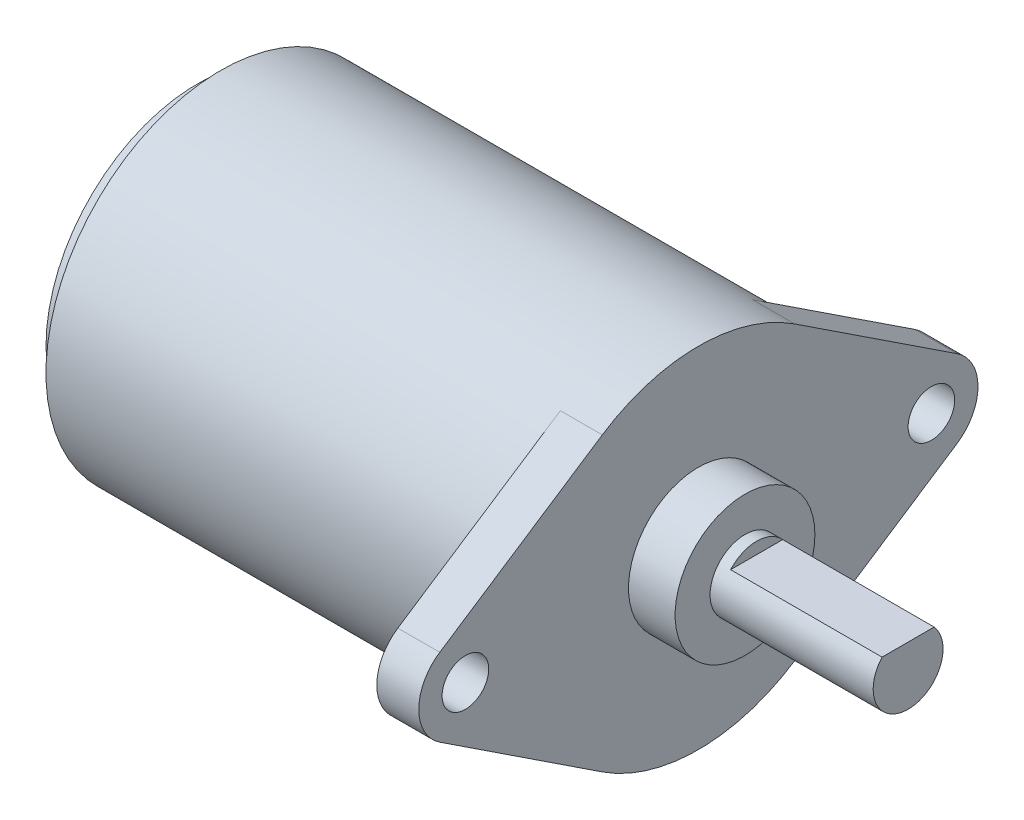
ISO-10303-21;
HEADER;
FILE_DESCRIPTION(('STEP AP214'),'2;1');
FILE_NAME('part.step','',(''),(''),'','','');
FILE_SCHEMA(('AUTOMOTIVE_DESIGN { 1 0 10303 214 1 1 1 1 }'));
ENDSEC;
DATA;
#1=APPLICATION_CONTEXT('core data for automotive mechanical design processes');
#2=APPLICATION_PROTOCOL_DEFINITION('international standard','automotive_design',2000,#1);
#3=PRODUCT_CONTEXT('',#1,'mechanical');
#4=PRODUCT('Part','Part','',(#3));
#5=PRODUCT_RELATED_PRODUCT_CATEGORY('part','',(#4));
#6=PRODUCT_DEFINITION_FORMATION('','',#4);
#7=PRODUCT_DEFINITION_CONTEXT('part definition',#1,'design');
#8=PRODUCT_DEFINITION('design','',#6,#7);
#9=PRODUCT_DEFINITION_SHAPE('','',#8);
#10=(LENGTH_UNIT() NAMED_UNIT(*) SI_UNIT(.MILLI.,.METRE.));
#11=(NAMED_UNIT(*) PLANE_ANGLE_UNIT() SI_UNIT($,.RADIAN.));
#12=(NAMED_UNIT(*) SI_UNIT($,.STERADIAN.) SOLID_ANGLE_UNIT());
#13=UNCERTAINTY_MEASURE_WITH_UNIT(LENGTH_MEASURE(1.E-05),#10,'distance_accuracy_value','');
#14=(GEOMETRIC_REPRESENTATION_CONTEXT(3) GLOBAL_UNCERTAINTY_ASSIGNED_CONTEXT((#13)) GLOBAL_UNIT_ASSIGNED_CONTEXT((#10,
#11,#12)) REPRESENTATION_CONTEXT('',''));
#15=CARTESIAN_POINT('',(0.,0.,0.));
#16=DIRECTION('',(0.,0.,1.));
#17=DIRECTION('',(1.,0.,0.));
#18=AXIS2_PLACEMENT_3D('',#15,#16,#17);
#19=CARTESIAN_POINT('',(18.7,0.,0.));
#20=DIRECTION('',(-1.,0.,0.));
#21=DIRECTION('',(0.,0.,1.));
#22=AXIS2_PLACEMENT_3D('',#19,#20,#21);
#23=CYLINDRICAL_SURFACE('',#22,7.5);
#24=CARTESIAN_POINT('',(18.7,0.,0.));
#25=DIRECTION('',(1.,0.,0.));
#26=DIRECTION('',(0.,0.,-1.));
#27=AXIS2_PLACEMENT_3D('',#24,#25,#26);
#28=CIRCLE('',#27,7.5);
#29=CARTESIAN_POINT('',(18.7,6.26373490818378,4.125));
#30=VERTEX_POINT('',#29);
#31=CARTESIAN_POINT('',(18.7,-6.26373490818378,4.125));
#32=VERTEX_POINT('',#31);
#33=EDGE_CURVE('E161',#30,#32,#28,.T.);
#34=ORIENTED_EDGE('',*,*,#33,.F.);
#35=DIRECTION('',(-1.,0.,0.));
#36=VECTOR('',#35,1.);
#37=CARTESIAN_POINT('',(20.5,6.26373490818378,4.125));
#38=LINE('',#37,#36);
#39=CARTESIAN_POINT('',(20.5,6.26373490818378,4.125));
#40=VERTEX_POINT('',#39);
#41=EDGE_CURVE('E223',#40,#30,#38,.T.);
#42=ORIENTED_EDGE('',*,*,#41,.F.);
#43=CARTESIAN_POINT('',(20.5,0.,0.));
#44=DIRECTION('',(1.,0.,0.));
#45=DIRECTION('',(0.,0.,-1.));
#46=AXIS2_PLACEMENT_3D('',#43,#44,#45);
#47=CIRCLE('',#46,7.5);
#48=CARTESIAN_POINT('',(20.5,6.26373490818378,-4.125));
#49=VERTEX_POINT('',#48);
#50=EDGE_CURVE('E174',#49,#40,#47,.T.);
#51=ORIENTED_EDGE('',*,*,#50,.F.);
#52=DIRECTION('',(-1.,0.,0.));
#53=VECTOR('',#52,1.);
#54=CARTESIAN_POINT('',(20.5,6.26373490818378,-4.125));
#55=LINE('',#54,#53);
#56=CARTESIAN_POINT('',(18.7,6.26373490818378,-4.125));
#57=VERTEX_POINT('',#56);
#58=EDGE_CURVE('E192',#49,#57,#55,.T.);
#59=ORIENTED_EDGE('',*,*,#58,.T.);
#60=CARTESIAN_POINT('',(18.7,-6.26373490818378,-4.125));
#61=VERTEX_POINT('',#60);
#62=EDGE_CURVE('E59',#61,#57,#28,.T.);
#63=ORIENTED_EDGE('',*,*,#62,.F.);
#64=DIRECTION('',(-1.,0.,0.));
#65=VECTOR('',#64,1.);
#66=CARTESIAN_POINT('',(20.5,-6.26373490818378,-4.125));
#67=LINE('',#66,#65);
#68=CARTESIAN_POINT('',(20.5,-6.26373490818378,-4.125));
#69=VERTEX_POINT('',#68);
#70=EDGE_CURVE('E212',#69,#61,#67,.T.);
#71=ORIENTED_EDGE('',*,*,#70,.F.);
#72=CARTESIAN_POINT('',(20.5,0.,0.));
#73=DIRECTION('',(1.,0.,0.));
#74=DIRECTION('',(0.,0.,-1.));
#75=AXIS2_PLACEMENT_3D('',#72,#73,#74);
#76=CIRCLE('',#75,7.5);
#77=CARTESIAN_POINT('',(20.5,-6.26373490818378,4.125));
#78=VERTEX_POINT('',#77);
#79=EDGE_CURVE('E184',#78,#69,#76,.T.);
#80=ORIENTED_EDGE('',*,*,#79,.F.);
#81=DIRECTION('',(-1.,0.,0.));
#82=VECTOR('',#81,1.);
#83=CARTESIAN_POINT('',(20.5,-6.26373490818378,4.125));
#84=LINE('',#83,#82);
#85=EDGE_CURVE('E214',#78,#32,#84,.T.);
#86=ORIENTED_EDGE('',*,*,#85,.T.);
#87=EDGE_LOOP('',(#34,#42,#51,#59,#63,#71,#80,#86));
#88=FACE_BOUND('',#87,.T.);
#89=CARTESIAN_POINT('',(0.,0.,0.));
#90=DIRECTION('',(1.,0.,0.));
#91=DIRECTION('',(0.,0.,-1.));
#92=AXIS2_PLACEMENT_3D('',#89,#90,#91);
#93=CIRCLE('',#92,7.5);
#94=CARTESIAN_POINT('',(0.,0.,-7.5));
#95=VERTEX_POINT('',#94);
#96=EDGE_CURVE('E39',#95,#95,#93,.T.);
#97=ORIENTED_EDGE('',*,*,#96,.T.);
#98=EDGE_LOOP('',(#97));
#99=FACE_BOUND('',#98,.T.);
#100=ADVANCED_FACE('F36',(#88,#99),#23,.T.);
#101=CARTESIAN_POINT('',(0.,0.,0.));
#102=DIRECTION('',(1.,0.,0.));
#103=DIRECTION('',(0.,0.,-1.));
#104=AXIS2_PLACEMENT_3D('',#101,#102,#103);
#105=PLANE('',#104);
#106=CARTESIAN_POINT('',(0.,0.,0.));
#107=DIRECTION('',(-1.,0.,0.));
#108=DIRECTION('',(0.,0.,1.));
#109=AXIS2_PLACEMENT_3D('',#106,#107,#108);
#110=CIRCLE('',#109,6.5);
#111=CARTESIAN_POINT('',(0.,0.,6.5));
#112=VERTEX_POINT('',#111);
#113=EDGE_CURVE('E155',#112,#112,#110,.T.);
#114=ORIENTED_EDGE('',*,*,#113,.F.);
#115=EDGE_LOOP('',(#114));
#116=FACE_BOUND('',#115,.T.);
#117=ORIENTED_EDGE('',*,*,#96,.F.);
#118=EDGE_LOOP('',(#117));
#119=FACE_BOUND('',#118,.T.);
#120=ADVANCED_FACE('F232',(#116,#119),#105,.F.);
#121=CARTESIAN_POINT('',(18.7,0.,0.));
#122=DIRECTION('',(1.,0.,0.));
#123=DIRECTION('',(0.,0.,-1.));
#124=AXIS2_PLACEMENT_3D('',#121,#122,#123);
#125=PLANE('',#124);
#126=CARTESIAN_POINT('',(18.7,0.,10.));
#127=DIRECTION('',(1.,0.,0.));
#128=DIRECTION('',(0.,0.,1.));
#129=AXIS2_PLACEMENT_3D('',#126,#127,#128);
#130=CIRCLE('',#129,1.);
#131=CARTESIAN_POINT('',(18.7,0.,11.));
#132=VERTEX_POINT('',#131);
#133=EDGE_CURVE('E158',#132,#132,#130,.T.);
#134=ORIENTED_EDGE('',*,*,#133,.T.);
#135=EDGE_LOOP('',(#134));
#136=FACE_BOUND('',#135,.T.);
#137=DIRECTION('',(0.,-0.55,0.835164654424503));
#138=VECTOR('',#137,1.);
#139=CARTESIAN_POINT('',(18.7,6.26373490818378,4.125));
#140=LINE('',#139,#138);
#141=CARTESIAN_POINT('',(18.7,1.67032930884901,11.1));
#142=VERTEX_POINT('',#141);
#143=EDGE_CURVE('E171',#30,#142,#140,.T.);
#144=ORIENTED_EDGE('',*,*,#143,.F.);
#145=ORIENTED_EDGE('',*,*,#33,.T.);
#146=DIRECTION('',(0.,-0.55,-0.835164654424503));
#147=VECTOR('',#146,1.);
#148=CARTESIAN_POINT('',(18.7,-6.26373490818378,4.125));
#149=LINE('',#148,#147);
#150=CARTESIAN_POINT('',(18.7,-1.67032930884901,11.1));
#151=VERTEX_POINT('',#150);
#152=EDGE_CURVE('E196',#151,#32,#149,.T.);
#153=ORIENTED_EDGE('',*,*,#152,.F.);
#154=CARTESIAN_POINT('',(18.7,0.,10.));
#155=DIRECTION('',(1.,0.,0.));
#156=DIRECTION('',(0.,0.,1.));
#157=AXIS2_PLACEMENT_3D('',#154,#155,#156);
#158=CIRCLE('',#157,2.);
#159=EDGE_CURVE('E194',#142,#151,#158,.T.);
#160=ORIENTED_EDGE('',*,*,#159,.F.);
#161=EDGE_LOOP('',(#144,#145,#153,#160));
#162=FACE_BOUND('',#161,.T.);
#163=ADVANCED_FACE('F234',(#136,#162),#125,.F.);
#164=CARTESIAN_POINT('',(18.7,0.,-10.));
#165=DIRECTION('',(1.,0.,0.));
#166=DIRECTION('',(0.,0.,-1.));
#167=AXIS2_PLACEMENT_3D('',#164,#165,#166);
#168=CIRCLE('',#167,1.);
#169=CARTESIAN_POINT('',(18.7,0.,-11.));
#170=VERTEX_POINT('',#169);
#171=EDGE_CURVE('E165',#170,#170,#168,.T.);
#172=ORIENTED_EDGE('',*,*,#171,.T.);
#173=EDGE_LOOP('',(#172));
#174=FACE_BOUND('',#173,.T.);
#175=DIRECTION('',(0.,0.55,-0.835164654424503));
#176=VECTOR('',#175,1.);
#177=CARTESIAN_POINT('',(18.7,-6.26373490818378,-4.125));
#178=LINE('',#177,#176);
#179=CARTESIAN_POINT('',(18.7,-1.67032930884901,-11.1));
#180=VERTEX_POINT('',#179);
#181=EDGE_CURVE('E199',#61,#180,#178,.T.);
#182=ORIENTED_EDGE('',*,*,#181,.F.);
#183=ORIENTED_EDGE('',*,*,#62,.T.);
#184=DIRECTION('',(0.,0.55,0.835164654424503));
#185=VECTOR('',#184,1.);
#186=CARTESIAN_POINT('',(18.7,6.26373490818378,-4.125));
#187=LINE('',#186,#185);
#188=CARTESIAN_POINT('',(18.7,1.67032930884901,-11.1));
#189=VERTEX_POINT('',#188);
#190=EDGE_CURVE('E178',#189,#57,#187,.T.);
#191=ORIENTED_EDGE('',*,*,#190,.F.);
#192=CARTESIAN_POINT('',(18.7,0.,-10.));
#193=DIRECTION('',(1.,0.,0.));
#194=DIRECTION('',(0.,0.,-1.));
#195=AXIS2_PLACEMENT_3D('',#192,#193,#194);
#196=CIRCLE('',#195,2.);
#197=EDGE_CURVE('E201',#180,#189,#196,.T.);
#198=ORIENTED_EDGE('',*,*,#197,.F.);
#199=EDGE_LOOP('',(#182,#183,#191,#198));
#200=FACE_BOUND('',#199,.T.);
#201=ADVANCED_FACE('F240',(#174,#200),#125,.F.);
#202=CARTESIAN_POINT('',(20.5,0.,0.));
#203=DIRECTION('',(1.,0.,0.));
#204=DIRECTION('',(0.,0.,-1.));
#205=AXIS2_PLACEMENT_3D('',#202,#203,#204);
#206=PLANE('',#205);
#207=CARTESIAN_POINT('',(20.5,0.,0.));
#208=DIRECTION('',(1.,0.,0.));
#209=DIRECTION('',(0.,0.,-1.));
#210=AXIS2_PLACEMENT_3D('',#207,#208,#209);
#211=CIRCLE('',#210,3.);
#212=CARTESIAN_POINT('',(20.5,0.,-3.));
#213=VERTEX_POINT('',#212);
#214=EDGE_CURVE('E133',#213,#213,#211,.T.);
#215=ORIENTED_EDGE('',*,*,#214,.F.);
#216=EDGE_LOOP('',(#215));
#217=FACE_BOUND('',#216,.T.);
#218=CARTESIAN_POINT('',(20.5,0.,-10.));
#219=DIRECTION('',(1.,0.,0.));
#220=DIRECTION('',(0.,0.,-1.));
#221=AXIS2_PLACEMENT_3D('',#218,#219,#220);
#222=CIRCLE('',#221,1.);
#223=CARTESIAN_POINT('',(20.5,0.,-11.));
#224=VERTEX_POINT('',#223);
#225=EDGE_CURVE('E168',#224,#224,#222,.T.);
#226=ORIENTED_EDGE('',*,*,#225,.F.);
#227=EDGE_LOOP('',(#226));
#228=FACE_BOUND('',#227,.T.);
#229=ORIENTED_EDGE('',*,*,#50,.T.);
#230=DIRECTION('',(0.,-0.55,0.835164654424503));
#231=VECTOR('',#230,1.);
#232=CARTESIAN_POINT('',(20.5,6.26373490818378,4.125));
#233=LINE('',#232,#231);
#234=CARTESIAN_POINT('',(20.5,1.67032930884901,11.1));
#235=VERTEX_POINT('',#234);
#236=EDGE_CURVE('E177',#40,#235,#233,.T.);
#237=ORIENTED_EDGE('',*,*,#236,.T.);
#238=CARTESIAN_POINT('',(20.5,0.,10.));
#239=DIRECTION('',(1.,0.,0.));
#240=DIRECTION('',(0.,0.,1.));
#241=AXIS2_PLACEMENT_3D('',#238,#239,#240);
#242=CIRCLE('',#241,2.);
#243=CARTESIAN_POINT('',(20.5,-1.67032930884901,11.1));
#244=VERTEX_POINT('',#243);
#245=EDGE_CURVE('E180',#235,#244,#242,.T.);
#246=ORIENTED_EDGE('',*,*,#245,.T.);
#247=DIRECTION('',(0.,-0.55,-0.835164654424503));
#248=VECTOR('',#247,1.);
#249=CARTESIAN_POINT('',(20.5,-6.26373490818378,4.125));
#250=LINE('',#249,#248);
#251=EDGE_CURVE('E182',#244,#78,#250,.T.);
#252=ORIENTED_EDGE('',*,*,#251,.T.);
#253=ORIENTED_EDGE('',*,*,#79,.T.);
#254=DIRECTION('',(0.,0.55,-0.835164654424503));
#255=VECTOR('',#254,1.);
#256=CARTESIAN_POINT('',(20.5,-6.26373490818378,-4.125));
#257=LINE('',#256,#255);
#258=CARTESIAN_POINT('',(20.5,-1.67032930884901,-11.1));
#259=VERTEX_POINT('',#258);
#260=EDGE_CURVE('E186',#69,#259,#257,.T.);
#261=ORIENTED_EDGE('',*,*,#260,.T.);
#262=CARTESIAN_POINT('',(20.5,0.,-10.));
#263=DIRECTION('',(1.,0.,0.));
#264=DIRECTION('',(0.,0.,-1.));
#265=AXIS2_PLACEMENT_3D('',#262,#263,#264);
#266=CIRCLE('',#265,2.);
#267=CARTESIAN_POINT('',(20.5,1.67032930884901,-11.1));
#268=VERTEX_POINT('',#267);
#269=EDGE_CURVE('E188',#259,#268,#266,.T.);
#270=ORIENTED_EDGE('',*,*,#269,.T.);
#271=DIRECTION('',(0.,0.55,0.835164654424503));
#272=VECTOR('',#271,1.);
#273=CARTESIAN_POINT('',(20.5,6.26373490818378,-4.125));
#274=LINE('',#273,#272);
#275=EDGE_CURVE('E190',#268,#49,#274,.T.);
#276=ORIENTED_EDGE('',*,*,#275,.T.);
#277=EDGE_LOOP('',(#229,#237,#246,#252,#253,#261,#270,#276));
#278=FACE_BOUND('',#277,.T.);
#279=CARTESIAN_POINT('',(20.5,0.,10.));
#280=DIRECTION('',(1.,0.,0.));
#281=DIRECTION('',(0.,0.,1.));
#282=AXIS2_PLACEMENT_3D('',#279,#280,#281);
#283=CIRCLE('',#282,1.);
#284=CARTESIAN_POINT('',(20.5,0.,11.));
#285=VERTEX_POINT('',#284);
#286=EDGE_CURVE('E162',#285,#285,#283,.T.);
#287=ORIENTED_EDGE('',*,*,#286,.F.);
#288=EDGE_LOOP('',(#287));
#289=FACE_BOUND('',#288,.T.);
#290=ADVANCED_FACE('F249',(#217,#228,#278,#289),#206,.T.);
#291=CARTESIAN_POINT('',(20.5,6.26373490818378,4.125));
#292=DIRECTION('',(0.,-0.835164654424503,-0.55));
#293=DIRECTION('',(0.,0.55,-0.835164654424503));
#294=AXIS2_PLACEMENT_3D('',#291,#292,#293);
#295=PLANE('',#294);
#296=ORIENTED_EDGE('',*,*,#143,.T.);
#297=DIRECTION('',(-1.,0.,0.));
#298=VECTOR('',#297,1.);
#299=CARTESIAN_POINT('',(20.5,1.67032930884901,11.1));
#300=LINE('',#299,#298);
#301=EDGE_CURVE('E220',#235,#142,#300,.T.);
#302=ORIENTED_EDGE('',*,*,#301,.F.);
#303=ORIENTED_EDGE('',*,*,#236,.F.);
#304=ORIENTED_EDGE('',*,*,#41,.T.);
#305=EDGE_LOOP('',(#296,#302,#303,#304));
#306=FACE_BOUND('',#305,.T.);
#307=ADVANCED_FACE('F245',(#306),#295,.F.);
#308=CARTESIAN_POINT('',(20.5,0.,10.));
#309=DIRECTION('',(-1.,0.,0.));
#310=DIRECTION('',(0.,0.,1.));
#311=AXIS2_PLACEMENT_3D('',#308,#309,#310);
#312=CYLINDRICAL_SURFACE('',#311,2.);
#313=ORIENTED_EDGE('',*,*,#159,.T.);
#314=DIRECTION('',(-1.,0.,0.));
#315=VECTOR('',#314,1.);
#316=CARTESIAN_POINT('',(20.5,-1.67032930884901,11.1));
#317=LINE('',#316,#315);
#318=EDGE_CURVE('E217',#244,#151,#317,.T.);
#319=ORIENTED_EDGE('',*,*,#318,.F.);
#320=ORIENTED_EDGE('',*,*,#245,.F.);
#321=ORIENTED_EDGE('',*,*,#301,.T.);
#322=EDGE_LOOP('',(#313,#319,#320,#321));
#323=FACE_BOUND('',#322,.T.);
#324=ADVANCED_FACE('F248',(#323),#312,.T.);
#325=CARTESIAN_POINT('',(20.5,-6.26373490818378,4.125));
#326=DIRECTION('',(0.,0.835164654424503,-0.55));
#327=DIRECTION('',(0.,0.55,0.835164654424503));
#328=AXIS2_PLACEMENT_3D('',#325,#326,#327);
#329=PLANE('',#328);
#330=ORIENTED_EDGE('',*,*,#152,.T.);
#331=ORIENTED_EDGE('',*,*,#85,.F.);
#332=ORIENTED_EDGE('',*,*,#251,.F.);
#333=ORIENTED_EDGE('',*,*,#318,.T.);
#334=EDGE_LOOP('',(#330,#331,#332,#333));
#335=FACE_BOUND('',#334,.T.);
#336=ADVANCED_FACE('F253',(#335),#329,.F.);
#337=CARTESIAN_POINT('',(20.5,-6.26373490818378,-4.125));
#338=DIRECTION('',(0.,0.835164654424503,0.55));
#339=DIRECTION('',(0.,-0.55,0.835164654424503));
#340=AXIS2_PLACEMENT_3D('',#337,#338,#339);
#341=PLANE('',#340);
#342=ORIENTED_EDGE('',*,*,#181,.T.);
#343=DIRECTION('',(-1.,0.,0.));
#344=VECTOR('',#343,1.);
#345=CARTESIAN_POINT('',(20.5,-1.67032930884901,-11.1));
#346=LINE('',#345,#344);
#347=EDGE_CURVE('E209',#259,#180,#346,.T.);
#348=ORIENTED_EDGE('',*,*,#347,.F.);
#349=ORIENTED_EDGE('',*,*,#260,.F.);
#350=ORIENTED_EDGE('',*,*,#70,.T.);
#351=EDGE_LOOP('',(#342,#348,#349,#350));
#352=FACE_BOUND('',#351,.T.);
#353=ADVANCED_FACE('F257',(#352),#341,.F.);
#354=CARTESIAN_POINT('',(20.5,0.,-10.));
#355=DIRECTION('',(-1.,0.,0.));
#356=DIRECTION('',(0.,0.,1.));
#357=AXIS2_PLACEMENT_3D('',#354,#355,#356);
#358=CYLINDRICAL_SURFACE('',#357,2.);
#359=ORIENTED_EDGE('',*,*,#197,.T.);
#360=DIRECTION('',(-1.,0.,0.));
#361=VECTOR('',#360,1.);
#362=CARTESIAN_POINT('',(20.5,1.67032930884901,-11.1));
#363=LINE('',#362,#361);
#364=EDGE_CURVE('E206',#268,#189,#363,.T.);
#365=ORIENTED_EDGE('',*,*,#364,.F.);
#366=ORIENTED_EDGE('',*,*,#269,.F.);
#367=ORIENTED_EDGE('',*,*,#347,.T.);
#368=EDGE_LOOP('',(#359,#365,#366,#367));
#369=FACE_BOUND('',#368,.T.);
#370=ADVANCED_FACE('F261',(#369),#358,.T.);
#371=CARTESIAN_POINT('',(20.5,6.26373490818378,-4.125));
#372=DIRECTION('',(0.,-0.835164654424503,0.55));
#373=DIRECTION('',(0.,-0.55,-0.835164654424503));
#374=AXIS2_PLACEMENT_3D('',#371,#372,#373);
#375=PLANE('',#374);
#376=ORIENTED_EDGE('',*,*,#190,.T.);
#377=ORIENTED_EDGE('',*,*,#58,.F.);
#378=ORIENTED_EDGE('',*,*,#275,.F.);
#379=ORIENTED_EDGE('',*,*,#364,.T.);
#380=EDGE_LOOP('',(#376,#377,#378,#379));
#381=FACE_BOUND('',#380,.T.);
#382=ADVANCED_FACE('F265',(#381),#375,.F.);
#383=CARTESIAN_POINT('',(20.5,0.,-10.));
#384=DIRECTION('',(-1.,0.,0.));
#385=DIRECTION('',(0.,0.,1.));
#386=AXIS2_PLACEMENT_3D('',#383,#384,#385);
#387=CYLINDRICAL_SURFACE('',#386,1.);
#388=ORIENTED_EDGE('',*,*,#225,.T.);
#389=EDGE_LOOP('',(#388));
#390=FACE_BOUND('',#389,.T.);
#391=ORIENTED_EDGE('',*,*,#171,.F.);
#392=EDGE_LOOP('',(#391));
#393=FACE_BOUND('',#392,.T.);
#394=ADVANCED_FACE('F268',(#390,#393),#387,.F.);
#395=CARTESIAN_POINT('',(20.5,0.,10.));
#396=DIRECTION('',(-1.,0.,0.));
#397=DIRECTION('',(0.,0.,1.));
#398=AXIS2_PLACEMENT_3D('',#395,#396,#397);
#399=CYLINDRICAL_SURFACE('',#398,1.);
#400=ORIENTED_EDGE('',*,*,#286,.T.);
#401=EDGE_LOOP('',(#400));
#402=FACE_BOUND('',#401,.T.);
#403=ORIENTED_EDGE('',*,*,#133,.F.);
#404=EDGE_LOOP('',(#403));
#405=FACE_BOUND('',#404,.T.);
#406=ADVANCED_FACE('F276',(#402,#405),#399,.F.);
#407=CARTESIAN_POINT('',(-1.,0.,0.));
#408=DIRECTION('',(1.,0.,0.));
#409=DIRECTION('',(0.,0.,-1.));
#410=AXIS2_PLACEMENT_3D('',#407,#408,#409);
#411=CYLINDRICAL_SURFACE('',#410,6.5);
#412=CARTESIAN_POINT('',(-1.,0.,0.));
#413=DIRECTION('',(-1.,0.,0.));
#414=DIRECTION('',(0.,0.,1.));
#415=AXIS2_PLACEMENT_3D('',#412,#413,#414);
#416=CIRCLE('',#415,6.5);
#417=CARTESIAN_POINT('',(-1.,0.,6.5));
#418=VERTEX_POINT('',#417);
#419=EDGE_CURVE('E152',#418,#418,#416,.T.);
#420=ORIENTED_EDGE('',*,*,#419,.F.);
#421=EDGE_LOOP('',(#420));
#422=FACE_BOUND('',#421,.T.);
#423=ORIENTED_EDGE('',*,*,#113,.T.);
#424=EDGE_LOOP('',(#423));
#425=FACE_BOUND('',#424,.T.);
#426=ADVANCED_FACE('F280',(#422,#425),#411,.T.);
#427=CARTESIAN_POINT('',(-1.,0.,0.));
#428=DIRECTION('',(-1.,0.,0.));
#429=DIRECTION('',(0.,0.,1.));
#430=AXIS2_PLACEMENT_3D('',#427,#428,#429);
#431=PLANE('',#430);
#432=CARTESIAN_POINT('',(-1.,0.,0.));
#433=DIRECTION('',(-1.,0.,0.));
#434=DIRECTION('',(0.,0.,1.));
#435=AXIS2_PLACEMENT_3D('',#432,#433,#434);
#436=CIRCLE('',#435,2.7);
#437=CARTESIAN_POINT('',(-1.,0.,2.7));
#438=VERTEX_POINT('',#437);
#439=EDGE_CURVE('E149',#438,#438,#436,.T.);
#440=ORIENTED_EDGE('',*,*,#439,.F.);
#441=EDGE_LOOP('',(#440));
#442=FACE_BOUND('',#441,.T.);
#443=ORIENTED_EDGE('',*,*,#419,.T.);
#444=EDGE_LOOP('',(#443));
#445=FACE_BOUND('',#444,.T.);
#446=ADVANCED_FACE('F284',(#442,#445),#431,.T.);
#447=CARTESIAN_POINT('',(-2.,0.,0.));
#448=DIRECTION('',(1.,0.,0.));
#449=DIRECTION('',(0.,0.,-1.));
#450=AXIS2_PLACEMENT_3D('',#447,#448,#449);
#451=CYLINDRICAL_SURFACE('',#450,2.7);
#452=CARTESIAN_POINT('',(-2.,0.,0.));
#453=DIRECTION('',(-1.,0.,0.));
#454=DIRECTION('',(0.,0.,1.));
#455=AXIS2_PLACEMENT_3D('',#452,#453,#454);
#456=CIRCLE('',#455,2.7);
#457=CARTESIAN_POINT('',(-2.,0.,2.7));
#458=VERTEX_POINT('',#457);
#459=EDGE_CURVE('E146',#458,#458,#456,.T.);
#460=ORIENTED_EDGE('',*,*,#459,.F.);
#461=EDGE_LOOP('',(#460));
#462=FACE_BOUND('',#461,.T.);
#463=ORIENTED_EDGE('',*,*,#439,.T.);
#464=EDGE_LOOP('',(#463));
#465=FACE_BOUND('',#464,.T.);
#466=ADVANCED_FACE('F288',(#462,#465),#451,.T.);
#467=CARTESIAN_POINT('',(-2.,0.,0.));
#468=DIRECTION('',(-1.,0.,0.));
#469=DIRECTION('',(0.,0.,1.));
#470=AXIS2_PLACEMENT_3D('',#467,#468,#469);
#471=PLANE('',#470);
#472=CARTESIAN_POINT('',(-2.,0.,0.));
#473=DIRECTION('',(-1.,0.,0.));
#474=DIRECTION('',(0.,0.,1.));
#475=AXIS2_PLACEMENT_3D('',#472,#473,#474);
#476=CIRCLE('',#475,0.75);
#477=CARTESIAN_POINT('',(-2.,0.,0.75));
#478=VERTEX_POINT('',#477);
#479=EDGE_CURVE('E44',#478,#478,#476,.T.);
#480=ORIENTED_EDGE('',*,*,#479,.F.);
#481=EDGE_LOOP('',(#480));
#482=FACE_BOUND('',#481,.T.);
#483=ORIENTED_EDGE('',*,*,#459,.T.);
#484=EDGE_LOOP('',(#483));
#485=FACE_BOUND('',#484,.T.);
#486=ADVANCED_FACE('F292',(#482,#485),#471,.T.);
#487=CARTESIAN_POINT('',(-2.5,0.,0.));
#488=DIRECTION('',(1.,0.,0.));
#489=DIRECTION('',(0.,0.,-1.));
#490=AXIS2_PLACEMENT_3D('',#487,#488,#489);
#491=CYLINDRICAL_SURFACE('',#490,0.75);
#492=CARTESIAN_POINT('',(-2.5,0.,0.));
#493=DIRECTION('',(-1.,0.,0.));
#494=DIRECTION('',(0.,0.,1.));
#495=AXIS2_PLACEMENT_3D('',#492,#493,#494);
#496=CIRCLE('',#495,0.75);
#497=CARTESIAN_POINT('',(-2.5,0.,0.75));
#498=VERTEX_POINT('',#497);
#499=EDGE_CURVE('E141',#498,#498,#496,.T.);
#500=ORIENTED_EDGE('',*,*,#499,.F.);
#501=EDGE_LOOP('',(#500));
#502=FACE_BOUND('',#501,.T.);
#503=ORIENTED_EDGE('',*,*,#479,.T.);
#504=EDGE_LOOP('',(#503));
#505=FACE_BOUND('',#504,.T.);
#506=ADVANCED_FACE('F296',(#502,#505),#491,.T.);
#507=CARTESIAN_POINT('',(-2.5,0.,0.));
#508=DIRECTION('',(-1.,0.,0.));
#509=DIRECTION('',(0.,0.,1.));
#510=AXIS2_PLACEMENT_3D('',#507,#508,#509);
#511=PLANE('',#510);
#512=ORIENTED_EDGE('',*,*,#499,.T.);
#513=EDGE_LOOP('',(#512));
#514=FACE_BOUND('',#513,.T.);
#515=ADVANCED_FACE('F300',(#514),#511,.T.);
#516=CARTESIAN_POINT('',(22.5,0.,0.));
#517=DIRECTION('',(-1.,0.,0.));
#518=DIRECTION('',(0.,0.,1.));
#519=AXIS2_PLACEMENT_3D('',#516,#517,#518);
#520=CYLINDRICAL_SURFACE('',#519,3.);
#521=CARTESIAN_POINT('',(22.5,0.,0.));
#522=DIRECTION('',(1.,0.,0.));
#523=DIRECTION('',(0.,0.,-1.));
#524=AXIS2_PLACEMENT_3D('',#521,#522,#523);
#525=CIRCLE('',#524,3.);
#526=CARTESIAN_POINT('',(22.5,0.,-3.));
#527=VERTEX_POINT('',#526);
#528=EDGE_CURVE('E138',#527,#527,#525,.T.);
#529=ORIENTED_EDGE('',*,*,#528,.F.);
#530=EDGE_LOOP('',(#529));
#531=FACE_BOUND('',#530,.T.);
#532=ORIENTED_EDGE('',*,*,#214,.T.);
#533=EDGE_LOOP('',(#532));
#534=FACE_BOUND('',#533,.T.);
#535=ADVANCED_FACE('F304',(#531,#534),#520,.T.);
#536=CARTESIAN_POINT('',(22.5,0.,0.));
#537=DIRECTION('',(1.,0.,0.));
#538=DIRECTION('',(0.,0.,-1.));
#539=AXIS2_PLACEMENT_3D('',#536,#537,#538);
#540=PLANE('',#539);
#541=CARTESIAN_POINT('',(22.5,0.,0.));
#542=DIRECTION('',(1.,0.,0.));
#543=DIRECTION('',(0.,0.,-1.));
#544=AXIS2_PLACEMENT_3D('',#541,#542,#543);
#545=CIRCLE('',#544,1.5);
#546=CARTESIAN_POINT('',(22.5,0.,-1.5));
#547=VERTEX_POINT('',#546);
#548=EDGE_CURVE('E11',#547,#547,#545,.T.);
#549=ORIENTED_EDGE('',*,*,#548,.F.);
#550=EDGE_LOOP('',(#549));
#551=FACE_BOUND('',#550,.T.);
#552=ORIENTED_EDGE('',*,*,#528,.T.);
#553=EDGE_LOOP('',(#552));
#554=FACE_BOUND('',#553,.T.);
#555=ADVANCED_FACE('F308',(#551,#554),#540,.T.);
#556=CARTESIAN_POINT('',(23.,0.,0.));
#557=DIRECTION('',(-1.,0.,0.));
#558=DIRECTION('',(0.,0.,1.));
#559=AXIS2_PLACEMENT_3D('',#556,#557,#558);
#560=CYLINDRICAL_SURFACE('',#559,1.5);
#561=CARTESIAN_POINT('',(23.,0.,0.));
#562=DIRECTION('',(1.,0.,0.));
#563=DIRECTION('',(0.,0.,-1.));
#564=AXIS2_PLACEMENT_3D('',#561,#562,#563);
#565=CIRCLE('',#564,1.5);
#566=CARTESIAN_POINT('',(23.,1.,-1.1180339887499));
#567=VERTEX_POINT('',#566);
#568=CARTESIAN_POINT('',(23.,1.,1.1180339887499));
#569=VERTEX_POINT('',#568);
#570=EDGE_CURVE('E131',#567,#569,#565,.T.);
#571=ORIENTED_EDGE('',*,*,#570,.F.);
#572=DIRECTION('',(-1.,0.,0.));
#573=VECTOR('',#572,1.);
#574=CARTESIAN_POINT('',(29.5,1.,-1.1180339887499));
#575=LINE('',#574,#573);
#576=CARTESIAN_POINT('',(29.5,1.,-1.1180339887499));
#577=VERTEX_POINT('',#576);
#578=EDGE_CURVE('E123',#577,#567,#575,.T.);
#579=ORIENTED_EDGE('',*,*,#578,.F.);
#580=CARTESIAN_POINT('',(29.5,0.,0.));
#581=DIRECTION('',(1.,0.,0.));
#582=DIRECTION('',(0.,0.,-1.));
#583=AXIS2_PLACEMENT_3D('',#580,#581,#582);
#584=CIRCLE('',#583,1.5);
#585=CARTESIAN_POINT('',(29.5,1.,1.1180339887499));
#586=VERTEX_POINT('',#585);
#587=EDGE_CURVE('E116',#586,#577,#584,.T.);
#588=ORIENTED_EDGE('',*,*,#587,.F.);
#589=DIRECTION('',(-1.,0.,0.));
#590=VECTOR('',#589,1.);
#591=CARTESIAN_POINT('',(29.5,1.,1.1180339887499));
#592=LINE('',#591,#590);
#593=EDGE_CURVE('E121',#586,#569,#592,.T.);
#594=ORIENTED_EDGE('',*,*,#593,.T.);
#595=EDGE_LOOP('',(#571,#579,#588,#594));
#596=FACE_BOUND('',#595,.T.);
#597=ORIENTED_EDGE('',*,*,#548,.T.);
#598=EDGE_LOOP('',(#597));
#599=FACE_BOUND('',#598,.T.);
#600=ADVANCED_FACE('F118',(#596,#599),#560,.T.);
#601=CARTESIAN_POINT('',(23.,0.,0.));
#602=DIRECTION('',(1.,0.,0.));
#603=DIRECTION('',(0.,0.,-1.));
#604=AXIS2_PLACEMENT_3D('',#601,#602,#603);
#605=PLANE('',#604);
#606=DIRECTION('',(0.,0.,1.));
#607=VECTOR('',#606,1.);
#608=CARTESIAN_POINT('',(23.,1.,0.));
#609=LINE('',#608,#607);
#610=EDGE_CURVE('E51',#567,#569,#609,.T.);
#611=ORIENTED_EDGE('',*,*,#610,.F.);
#612=ORIENTED_EDGE('',*,*,#570,.T.);
#613=EDGE_LOOP('',(#611,#612));
#614=FACE_BOUND('',#613,.T.);
#615=ADVANCED_FACE('F315',(#614),#605,.T.);
#616=CARTESIAN_POINT('',(29.5,1.,0.));
#617=DIRECTION('',(0.,-1.,0.));
#618=DIRECTION('',(0.,0.,-1.));
#619=AXIS2_PLACEMENT_3D('',#616,#617,#618);
#620=PLANE('',#619);
#621=ORIENTED_EDGE('',*,*,#610,.T.);
#622=ORIENTED_EDGE('',*,*,#593,.F.);
#623=DIRECTION('',(0.,0.,1.));
#624=VECTOR('',#623,1.);
#625=CARTESIAN_POINT('',(29.5,1.,0.));
#626=LINE('',#625,#624);
#627=EDGE_CURVE('E125',#577,#586,#626,.T.);
#628=ORIENTED_EDGE('',*,*,#627,.F.);
#629=ORIENTED_EDGE('',*,*,#578,.T.);
#630=EDGE_LOOP('',(#621,#622,#628,#629));
#631=FACE_BOUND('',#630,.T.);
#632=ADVANCED_FACE('F130',(#631),#620,.F.);
#633=CARTESIAN_POINT('',(29.5,0.,0.));
#634=DIRECTION('',(1.,0.,0.));
#635=DIRECTION('',(0.,0.,-1.));
#636=AXIS2_PLACEMENT_3D('',#633,#634,#635);
#637=PLANE('',#636);
#638=ORIENTED_EDGE('',*,*,#627,.T.);
#639=ORIENTED_EDGE('',*,*,#587,.T.);
#640=EDGE_LOOP('',(#638,#639));
#641=FACE_BOUND('',#640,.T.);
#642=ADVANCED_FACE('F127',(#641),#637,.T.);
#643=CLOSED_SHELL('',(#100,#120,#163,#201,#290,#307,#324,#336,#353,#370,#382,#394,#406,#426,
#446,#466,#486,#506,#515,#535,#555,#600,#615,#632,#642));
#644=MANIFOLD_SOLID_BREP('B2',#643);
#645=ADVANCED_BREP_SHAPE_REPRESENTATION('',(#18,#644),#14);
#646=SHAPE_DEFINITION_REPRESENTATION(#9,#645);
ENDSEC;
END-ISO-10303-21;
